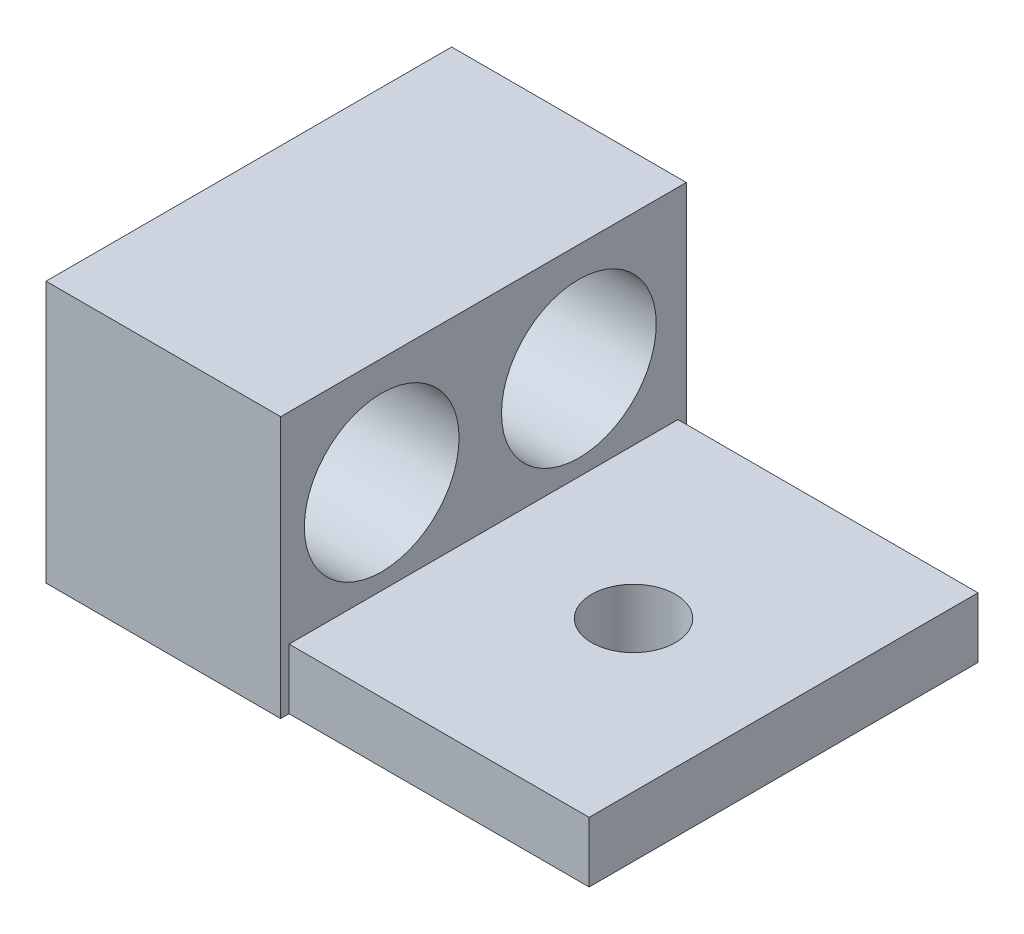
ISO-10303-21;
HEADER;
FILE_DESCRIPTION(('STEP AP214'),'2;1');
FILE_NAME('part.step','',(''),(''),'','','');
FILE_SCHEMA(('AUTOMOTIVE_DESIGN { 1 0 10303 214 1 1 1 1 }'));
ENDSEC;
DATA;
#1=APPLICATION_CONTEXT('core data for automotive mechanical design processes');
#2=APPLICATION_PROTOCOL_DEFINITION('international standard','automotive_design',2000,#1);
#3=PRODUCT_CONTEXT('',#1,'mechanical');
#4=PRODUCT('Part','Part','',(#3));
#5=PRODUCT_RELATED_PRODUCT_CATEGORY('part','',(#4));
#6=PRODUCT_DEFINITION_FORMATION('','',#4);
#7=PRODUCT_DEFINITION_CONTEXT('part definition',#1,'design');
#8=PRODUCT_DEFINITION('design','',#6,#7);
#9=PRODUCT_DEFINITION_SHAPE('','',#8);
#10=(LENGTH_UNIT() NAMED_UNIT(*) SI_UNIT(.MILLI.,.METRE.));
#11=(NAMED_UNIT(*) PLANE_ANGLE_UNIT() SI_UNIT($,.RADIAN.));
#12=(NAMED_UNIT(*) SI_UNIT($,.STERADIAN.) SOLID_ANGLE_UNIT());
#13=UNCERTAINTY_MEASURE_WITH_UNIT(LENGTH_MEASURE(1.E-05),#10,'distance_accuracy_value','');
#14=(GEOMETRIC_REPRESENTATION_CONTEXT(3) GLOBAL_UNCERTAINTY_ASSIGNED_CONTEXT((#13)) GLOBAL_UNIT_ASSIGNED_CONTEXT((#10,
#11,#12)) REPRESENTATION_CONTEXT('',''));
#15=CARTESIAN_POINT('',(0.,0.,0.));
#16=DIRECTION('',(0.,0.,1.));
#17=DIRECTION('',(1.,0.,0.));
#18=AXIS2_PLACEMENT_3D('',#15,#16,#17);
#19=CARTESIAN_POINT('',(0.,0.,-61.468));
#20=DIRECTION('',(-1.,0.,0.));
#21=DIRECTION('',(0.,0.,1.));
#22=AXIS2_PLACEMENT_3D('',#19,#20,#21);
#23=PLANE('',#22);
#24=CARTESIAN_POINT('',(0.,23.3372347603478,-45.18450858005));
#25=DIRECTION('',(1.,0.,0.));
#26=DIRECTION('',(0.,1.,0.));
#27=AXIS2_PLACEMENT_3D('',#24,#25,#26);
#28=CIRCLE('',#27,11.7221);
#29=CARTESIAN_POINT('',(0.,35.0593347603478,-45.18450858005));
#30=VERTEX_POINT('',#29);
#31=EDGE_CURVE('E183',#30,#30,#28,.T.);
#32=ORIENTED_EDGE('',*,*,#31,.T.);
#33=EDGE_LOOP('',(#32));
#34=FACE_BOUND('',#33,.T.);
#35=CARTESIAN_POINT('',(0.,23.3372347603478,-15.3073485723922));
#36=DIRECTION('',(1.,0.,0.));
#37=DIRECTION('',(0.,1.,0.));
#38=AXIS2_PLACEMENT_3D('',#35,#36,#37);
#39=CIRCLE('',#38,11.7221);
#40=CARTESIAN_POINT('',(0.,35.0593347603478,-15.3073485723922));
#41=VERTEX_POINT('',#40);
#42=EDGE_CURVE('E177',#41,#41,#39,.T.);
#43=ORIENTED_EDGE('',*,*,#42,.T.);
#44=EDGE_LOOP('',(#43));
#45=FACE_BOUND('',#44,.T.);
#46=DIRECTION('',(0.,-1.,0.));
#47=VECTOR('',#46,1.);
#48=CARTESIAN_POINT('',(0.,0.,0.));
#49=LINE('',#48,#47);
#50=CARTESIAN_POINT('',(0.,39.624,0.));
#51=VERTEX_POINT('',#50);
#52=CARTESIAN_POINT('',(0.,0.,0.));
#53=VERTEX_POINT('',#52);
#54=EDGE_CURVE('E131',#51,#53,#49,.T.);
#55=ORIENTED_EDGE('',*,*,#54,.F.);
#56=DIRECTION('',(0.,0.,1.));
#57=VECTOR('',#56,1.);
#58=CARTESIAN_POINT('',(0.,39.624,-61.468));
#59=LINE('',#58,#57);
#60=CARTESIAN_POINT('',(0.,39.624,-61.468));
#61=VERTEX_POINT('',#60);
#62=EDGE_CURVE('E11',#61,#51,#59,.T.);
#63=ORIENTED_EDGE('',*,*,#62,.F.);
#64=DIRECTION('',(0.,-1.,0.));
#65=VECTOR('',#64,1.);
#66=CARTESIAN_POINT('',(0.,0.,-61.468));
#67=LINE('',#66,#65);
#68=CARTESIAN_POINT('',(0.,0.,-61.468));
#69=VERTEX_POINT('',#68);
#70=EDGE_CURVE('E124',#61,#69,#67,.T.);
#71=ORIENTED_EDGE('',*,*,#70,.T.);
#72=DIRECTION('',(0.,0.,1.));
#73=VECTOR('',#72,1.);
#74=CARTESIAN_POINT('',(0.,0.,-61.468));
#75=LINE('',#74,#73);
#76=EDGE_CURVE('E37',#69,#53,#75,.T.);
#77=ORIENTED_EDGE('',*,*,#76,.T.);
#78=EDGE_LOOP('',(#55,#63,#71,#77));
#79=FACE_BOUND('',#78,.T.);
#80=ADVANCED_FACE('F34',(#34,#45,#79),#23,.T.);
#81=CARTESIAN_POINT('',(0.,39.624,-61.468));
#82=DIRECTION('',(0.,1.,0.));
#83=DIRECTION('',(0.,0.,1.));
#84=AXIS2_PLACEMENT_3D('',#81,#82,#83);
#85=PLANE('',#84);
#86=DIRECTION('',(0.,0.,1.));
#87=VECTOR('',#86,1.);
#88=CARTESIAN_POINT('',(35.56,39.624,-61.468));
#89=LINE('',#88,#87);
#90=CARTESIAN_POINT('',(35.56,39.624,-61.468));
#91=VERTEX_POINT('',#90);
#92=CARTESIAN_POINT('',(35.56,39.624,0.));
#93=VERTEX_POINT('',#92);
#94=EDGE_CURVE('E58',#91,#93,#89,.T.);
#95=ORIENTED_EDGE('',*,*,#94,.F.);
#96=DIRECTION('',(-1.,0.,0.));
#97=VECTOR('',#96,1.);
#98=CARTESIAN_POINT('',(0.,39.624,-61.468));
#99=LINE('',#98,#97);
#100=EDGE_CURVE('E109',#91,#61,#99,.T.);
#101=ORIENTED_EDGE('',*,*,#100,.T.);
#102=ORIENTED_EDGE('',*,*,#62,.T.);
#103=DIRECTION('',(-1.,0.,0.));
#104=VECTOR('',#103,1.);
#105=CARTESIAN_POINT('',(0.,39.624,0.));
#106=LINE('',#105,#104);
#107=EDGE_CURVE('E127',#93,#51,#106,.T.);
#108=ORIENTED_EDGE('',*,*,#107,.F.);
#109=EDGE_LOOP('',(#95,#101,#102,#108));
#110=FACE_BOUND('',#109,.T.);
#111=ADVANCED_FACE('F151',(#110),#85,.T.);
#112=CARTESIAN_POINT('',(81.026,0.,-61.468));
#113=DIRECTION('',(1.,0.,0.));
#114=DIRECTION('',(0.,0.,-1.));
#115=AXIS2_PLACEMENT_3D('',#112,#113,#114);
#116=PLANE('',#115);
#117=DIRECTION('',(0.,1.,0.));
#118=VECTOR('',#117,1.);
#119=CARTESIAN_POINT('',(81.026,0.,-60.198));
#120=LINE('',#119,#118);
#121=CARTESIAN_POINT('',(81.026,0.,-60.198));
#122=VERTEX_POINT('',#121);
#123=CARTESIAN_POINT('',(81.026,9.14400000000001,-60.198));
#124=VERTEX_POINT('',#123);
#125=EDGE_CURVE('E165',#122,#124,#120,.T.);
#126=ORIENTED_EDGE('',*,*,#125,.T.);
#127=DIRECTION('',(0.,0.,1.));
#128=VECTOR('',#127,1.);
#129=CARTESIAN_POINT('',(81.026,9.14400000000001,-61.468));
#130=LINE('',#129,#128);
#131=CARTESIAN_POINT('',(81.026,9.14400000000001,-1.27));
#132=VERTEX_POINT('',#131);
#133=EDGE_CURVE('E135',#124,#132,#130,.T.);
#134=ORIENTED_EDGE('',*,*,#133,.T.);
#135=DIRECTION('',(0.,1.,0.));
#136=VECTOR('',#135,1.);
#137=CARTESIAN_POINT('',(81.026,0.,-1.27));
#138=LINE('',#137,#136);
#139=CARTESIAN_POINT('',(81.026,0.,-1.27));
#140=VERTEX_POINT('',#139);
#141=EDGE_CURVE('E157',#140,#132,#138,.T.);
#142=ORIENTED_EDGE('',*,*,#141,.F.);
#143=DIRECTION('',(0.,0.,1.));
#144=VECTOR('',#143,1.);
#145=CARTESIAN_POINT('',(81.026,0.,-61.468));
#146=LINE('',#145,#144);
#147=EDGE_CURVE('E42',#122,#140,#146,.T.);
#148=ORIENTED_EDGE('',*,*,#147,.F.);
#149=EDGE_LOOP('',(#126,#134,#142,#148));
#150=FACE_BOUND('',#149,.T.);
#151=ADVANCED_FACE('F223',(#150),#116,.T.);
#152=CARTESIAN_POINT('',(0.,0.,-61.468));
#153=DIRECTION('',(0.,-1.,0.));
#154=DIRECTION('',(0.,0.,-1.));
#155=AXIS2_PLACEMENT_3D('',#152,#153,#154);
#156=PLANE('',#155);
#157=CARTESIAN_POINT('',(58.293,0.,-30.734));
#158=DIRECTION('',(0.,1.,0.));
#159=DIRECTION('',(-1.,0.,0.));
#160=AXIS2_PLACEMENT_3D('',#157,#158,#159);
#161=CIRCLE('',#160,6.35);
#162=CARTESIAN_POINT('',(51.943,0.,-30.734));
#163=VERTEX_POINT('',#162);
#164=EDGE_CURVE('E172',#163,#163,#161,.T.);
#165=ORIENTED_EDGE('',*,*,#164,.T.);
#166=EDGE_LOOP('',(#165));
#167=FACE_BOUND('',#166,.T.);
#168=DIRECTION('',(1.,0.,0.));
#169=VECTOR('',#168,1.);
#170=CARTESIAN_POINT('',(81.026,0.,-60.198));
#171=LINE('',#170,#169);
#172=CARTESIAN_POINT('',(35.56,0.,-60.198));
#173=VERTEX_POINT('',#172);
#174=EDGE_CURVE('E119',#173,#122,#171,.T.);
#175=ORIENTED_EDGE('',*,*,#174,.T.);
#176=ORIENTED_EDGE('',*,*,#147,.T.);
#177=DIRECTION('',(-1.,0.,0.));
#178=VECTOR('',#177,1.);
#179=CARTESIAN_POINT('',(81.026,0.,-1.27));
#180=LINE('',#179,#178);
#181=CARTESIAN_POINT('',(35.56,0.,-1.26999999999999));
#182=VERTEX_POINT('',#181);
#183=EDGE_CURVE('E164',#140,#182,#180,.T.);
#184=ORIENTED_EDGE('',*,*,#183,.T.);
#185=DIRECTION('',(0.,0.,1.));
#186=VECTOR('',#185,1.);
#187=CARTESIAN_POINT('',(35.56,0.,0.));
#188=LINE('',#187,#186);
#189=CARTESIAN_POINT('',(35.56,0.,0.));
#190=VERTEX_POINT('',#189);
#191=EDGE_CURVE('E146',#182,#190,#188,.T.);
#192=ORIENTED_EDGE('',*,*,#191,.T.);
#193=DIRECTION('',(1.,0.,0.));
#194=VECTOR('',#193,1.);
#195=CARTESIAN_POINT('',(0.,0.,0.));
#196=LINE('',#195,#194);
#197=EDGE_CURVE('E134',#53,#190,#196,.T.);
#198=ORIENTED_EDGE('',*,*,#197,.F.);
#199=ORIENTED_EDGE('',*,*,#76,.F.);
#200=DIRECTION('',(1.,0.,0.));
#201=VECTOR('',#200,1.);
#202=CARTESIAN_POINT('',(0.,0.,-61.468));
#203=LINE('',#202,#201);
#204=CARTESIAN_POINT('',(35.56,0.,-61.468));
#205=VERTEX_POINT('',#204);
#206=EDGE_CURVE('E107',#69,#205,#203,.T.);
#207=ORIENTED_EDGE('',*,*,#206,.T.);
#208=DIRECTION('',(0.,0.,1.));
#209=VECTOR('',#208,1.);
#210=CARTESIAN_POINT('',(35.56,0.,-61.468));
#211=LINE('',#210,#209);
#212=EDGE_CURVE('E113',#205,#173,#211,.T.);
#213=ORIENTED_EDGE('',*,*,#212,.T.);
#214=EDGE_LOOP('',(#175,#176,#184,#192,#198,#199,#207,#213));
#215=FACE_BOUND('',#214,.T.);
#216=ADVANCED_FACE('F122',(#167,#215),#156,.T.);
#217=CARTESIAN_POINT('',(0.,39.624,-61.468));
#218=DIRECTION('',(0.,0.,-1.));
#219=DIRECTION('',(-1.,0.,0.));
#220=AXIS2_PLACEMENT_3D('',#217,#218,#219);
#221=PLANE('',#220);
#222=DIRECTION('',(0.,-1.,0.));
#223=VECTOR('',#222,1.);
#224=CARTESIAN_POINT('',(35.56,39.624,-61.468));
#225=LINE('',#224,#223);
#226=EDGE_CURVE('E102',#91,#205,#225,.T.);
#227=ORIENTED_EDGE('',*,*,#226,.T.);
#228=ORIENTED_EDGE('',*,*,#206,.F.);
#229=ORIENTED_EDGE('',*,*,#70,.F.);
#230=ORIENTED_EDGE('',*,*,#100,.F.);
#231=EDGE_LOOP('',(#227,#228,#229,#230));
#232=FACE_BOUND('',#231,.T.);
#233=ADVANCED_FACE('F104',(#232),#221,.T.);
#234=CARTESIAN_POINT('',(0.,39.624,0.));
#235=DIRECTION('',(0.,0.,-1.));
#236=DIRECTION('',(-1.,0.,0.));
#237=AXIS2_PLACEMENT_3D('',#234,#235,#236);
#238=PLANE('',#237);
#239=ORIENTED_EDGE('',*,*,#197,.T.);
#240=DIRECTION('',(0.,-1.,0.));
#241=VECTOR('',#240,1.);
#242=CARTESIAN_POINT('',(35.56,39.624,0.));
#243=LINE('',#242,#241);
#244=EDGE_CURVE('E110',#93,#190,#243,.T.);
#245=ORIENTED_EDGE('',*,*,#244,.F.);
#246=ORIENTED_EDGE('',*,*,#107,.T.);
#247=ORIENTED_EDGE('',*,*,#54,.T.);
#248=EDGE_LOOP('',(#239,#245,#246,#247));
#249=FACE_BOUND('',#248,.T.);
#250=ADVANCED_FACE('F148',(#249),#238,.F.);
#251=CARTESIAN_POINT('',(81.026,9.14400000000001,-61.468));
#252=DIRECTION('',(0.,-1.,0.));
#253=DIRECTION('',(1.,0.,0.));
#254=AXIS2_PLACEMENT_3D('',#251,#252,#253);
#255=PLANE('',#254);
#256=CARTESIAN_POINT('',(58.293,9.14400000000001,-30.734));
#257=DIRECTION('',(0.,1.,0.));
#258=DIRECTION('',(-1.,0.,0.));
#259=AXIS2_PLACEMENT_3D('',#256,#257,#258);
#260=CIRCLE('',#259,6.35);
#261=CARTESIAN_POINT('',(51.943,9.14400000000001,-30.734));
#262=VERTEX_POINT('',#261);
#263=EDGE_CURVE('E174',#262,#262,#260,.T.);
#264=ORIENTED_EDGE('',*,*,#263,.F.);
#265=EDGE_LOOP('',(#264));
#266=FACE_BOUND('',#265,.T.);
#267=ORIENTED_EDGE('',*,*,#133,.F.);
#268=DIRECTION('',(1.,0.,0.));
#269=VECTOR('',#268,1.);
#270=CARTESIAN_POINT('',(81.026,9.14400000000001,-60.198));
#271=LINE('',#270,#269);
#272=CARTESIAN_POINT('',(35.56,9.144,-60.198));
#273=VERTEX_POINT('',#272);
#274=EDGE_CURVE('E120',#273,#124,#271,.T.);
#275=ORIENTED_EDGE('',*,*,#274,.F.);
#276=DIRECTION('',(0.,0.,1.));
#277=VECTOR('',#276,1.);
#278=CARTESIAN_POINT('',(35.56,9.144,-61.468));
#279=LINE('',#278,#277);
#280=CARTESIAN_POINT('',(35.56,9.144,-1.27));
#281=VERTEX_POINT('',#280);
#282=EDGE_CURVE('E50',#273,#281,#279,.T.);
#283=ORIENTED_EDGE('',*,*,#282,.T.);
#284=DIRECTION('',(-1.,0.,0.));
#285=VECTOR('',#284,1.);
#286=CARTESIAN_POINT('',(81.026,9.14400000000001,-1.27));
#287=LINE('',#286,#285);
#288=EDGE_CURVE('E162',#132,#281,#287,.T.);
#289=ORIENTED_EDGE('',*,*,#288,.F.);
#290=EDGE_LOOP('',(#267,#275,#283,#289));
#291=FACE_BOUND('',#290,.T.);
#292=ADVANCED_FACE('F204',(#266,#291),#255,.F.);
#293=CARTESIAN_POINT('',(35.56,39.624,-61.468));
#294=DIRECTION('',(-1.,0.,0.));
#295=DIRECTION('',(0.,-1.,0.));
#296=AXIS2_PLACEMENT_3D('',#293,#294,#295);
#297=PLANE('',#296);
#298=CARTESIAN_POINT('',(35.56,23.3372347603478,-45.18450858005));
#299=DIRECTION('',(1.,0.,0.));
#300=DIRECTION('',(0.,1.,0.));
#301=AXIS2_PLACEMENT_3D('',#298,#299,#300);
#302=CIRCLE('',#301,11.7221);
#303=CARTESIAN_POINT('',(35.56,35.0593347603478,-45.18450858005));
#304=VERTEX_POINT('',#303);
#305=EDGE_CURVE('E186',#304,#304,#302,.T.);
#306=ORIENTED_EDGE('',*,*,#305,.F.);
#307=EDGE_LOOP('',(#306));
#308=FACE_BOUND('',#307,.T.);
#309=CARTESIAN_POINT('',(35.56,23.3372347603478,-15.3073485723922));
#310=DIRECTION('',(1.,0.,0.));
#311=DIRECTION('',(0.,1.,0.));
#312=AXIS2_PLACEMENT_3D('',#309,#310,#311);
#313=CIRCLE('',#312,11.7221);
#314=CARTESIAN_POINT('',(35.56,35.0593347603478,-15.3073485723922));
#315=VERTEX_POINT('',#314);
#316=EDGE_CURVE('E180',#315,#315,#313,.T.);
#317=ORIENTED_EDGE('',*,*,#316,.F.);
#318=EDGE_LOOP('',(#317));
#319=FACE_BOUND('',#318,.T.);
#320=ORIENTED_EDGE('',*,*,#244,.T.);
#321=ORIENTED_EDGE('',*,*,#191,.F.);
#322=DIRECTION('',(0.,1.,0.));
#323=VECTOR('',#322,1.);
#324=CARTESIAN_POINT('',(35.56,0.,-1.26999999999999));
#325=LINE('',#324,#323);
#326=EDGE_CURVE('E155',#182,#281,#325,.T.);
#327=ORIENTED_EDGE('',*,*,#326,.T.);
#328=ORIENTED_EDGE('',*,*,#282,.F.);
#329=DIRECTION('',(0.,1.,0.));
#330=VECTOR('',#329,1.);
#331=CARTESIAN_POINT('',(35.56,0.,-60.198));
#332=LINE('',#331,#330);
#333=EDGE_CURVE('E115',#173,#273,#332,.T.);
#334=ORIENTED_EDGE('',*,*,#333,.F.);
#335=ORIENTED_EDGE('',*,*,#212,.F.);
#336=ORIENTED_EDGE('',*,*,#226,.F.);
#337=ORIENTED_EDGE('',*,*,#94,.T.);
#338=EDGE_LOOP('',(#320,#321,#327,#328,#334,#335,#336,#337));
#339=FACE_BOUND('',#338,.T.);
#340=ADVANCED_FACE('F114',(#308,#319,#339),#297,.F.);
#341=CARTESIAN_POINT('',(81.026,0.,-1.27));
#342=DIRECTION('',(0.,0.,-1.));
#343=DIRECTION('',(-1.,0.,0.));
#344=AXIS2_PLACEMENT_3D('',#341,#342,#343);
#345=PLANE('',#344);
#346=ORIENTED_EDGE('',*,*,#288,.T.);
#347=ORIENTED_EDGE('',*,*,#326,.F.);
#348=ORIENTED_EDGE('',*,*,#183,.F.);
#349=ORIENTED_EDGE('',*,*,#141,.T.);
#350=EDGE_LOOP('',(#346,#347,#348,#349));
#351=FACE_BOUND('',#350,.T.);
#352=ADVANCED_FACE('F203',(#351),#345,.F.);
#353=CARTESIAN_POINT('',(81.026,0.,-60.198));
#354=DIRECTION('',(0.,0.,1.));
#355=DIRECTION('',(1.,0.,0.));
#356=AXIS2_PLACEMENT_3D('',#353,#354,#355);
#357=PLANE('',#356);
#358=ORIENTED_EDGE('',*,*,#274,.T.);
#359=ORIENTED_EDGE('',*,*,#125,.F.);
#360=ORIENTED_EDGE('',*,*,#174,.F.);
#361=ORIENTED_EDGE('',*,*,#333,.T.);
#362=EDGE_LOOP('',(#358,#359,#360,#361));
#363=FACE_BOUND('',#362,.T.);
#364=ADVANCED_FACE('F215',(#363),#357,.F.);
#365=CARTESIAN_POINT('',(58.293,0.,-30.734));
#366=DIRECTION('',(0.,1.,0.));
#367=DIRECTION('',(-1.,0.,0.));
#368=AXIS2_PLACEMENT_3D('',#365,#366,#367);
#369=CYLINDRICAL_SURFACE('',#368,6.35);
#370=ORIENTED_EDGE('',*,*,#164,.F.);
#371=EDGE_LOOP('',(#370));
#372=FACE_BOUND('',#371,.T.);
#373=ORIENTED_EDGE('',*,*,#263,.T.);
#374=EDGE_LOOP('',(#373));
#375=FACE_BOUND('',#374,.T.);
#376=ADVANCED_FACE('F209',(#372,#375),#369,.F.);
#377=CARTESIAN_POINT('',(0.,23.3372347603478,-15.3073485723922));
#378=DIRECTION('',(1.,0.,0.));
#379=DIRECTION('',(0.,1.,0.));
#380=AXIS2_PLACEMENT_3D('',#377,#378,#379);
#381=CYLINDRICAL_SURFACE('',#380,11.7221);
#382=ORIENTED_EDGE('',*,*,#42,.F.);
#383=EDGE_LOOP('',(#382));
#384=FACE_BOUND('',#383,.T.);
#385=ORIENTED_EDGE('',*,*,#316,.T.);
#386=EDGE_LOOP('',(#385));
#387=FACE_BOUND('',#386,.T.);
#388=ADVANCED_FACE('F197',(#384,#387),#381,.F.);
#389=CARTESIAN_POINT('',(0.,23.3372347603478,-45.18450858005));
#390=DIRECTION('',(1.,0.,0.));
#391=DIRECTION('',(0.,1.,0.));
#392=AXIS2_PLACEMENT_3D('',#389,#390,#391);
#393=CYLINDRICAL_SURFACE('',#392,11.7221);
#394=ORIENTED_EDGE('',*,*,#31,.F.);
#395=EDGE_LOOP('',(#394));
#396=FACE_BOUND('',#395,.T.);
#397=ORIENTED_EDGE('',*,*,#305,.T.);
#398=EDGE_LOOP('',(#397));
#399=FACE_BOUND('',#398,.T.);
#400=ADVANCED_FACE('F194',(#396,#399),#393,.F.);
#401=CLOSED_SHELL('',(#80,#111,#151,#216,#233,#250,#292,#340,#352,#364,#376,#388,#400));
#402=MANIFOLD_SOLID_BREP('B2',#401);
#403=ADVANCED_BREP_SHAPE_REPRESENTATION('',(#18,#402),#14);
#404=SHAPE_DEFINITION_REPRESENTATION(#9,#403);
ENDSEC;
END-ISO-10303-21;
